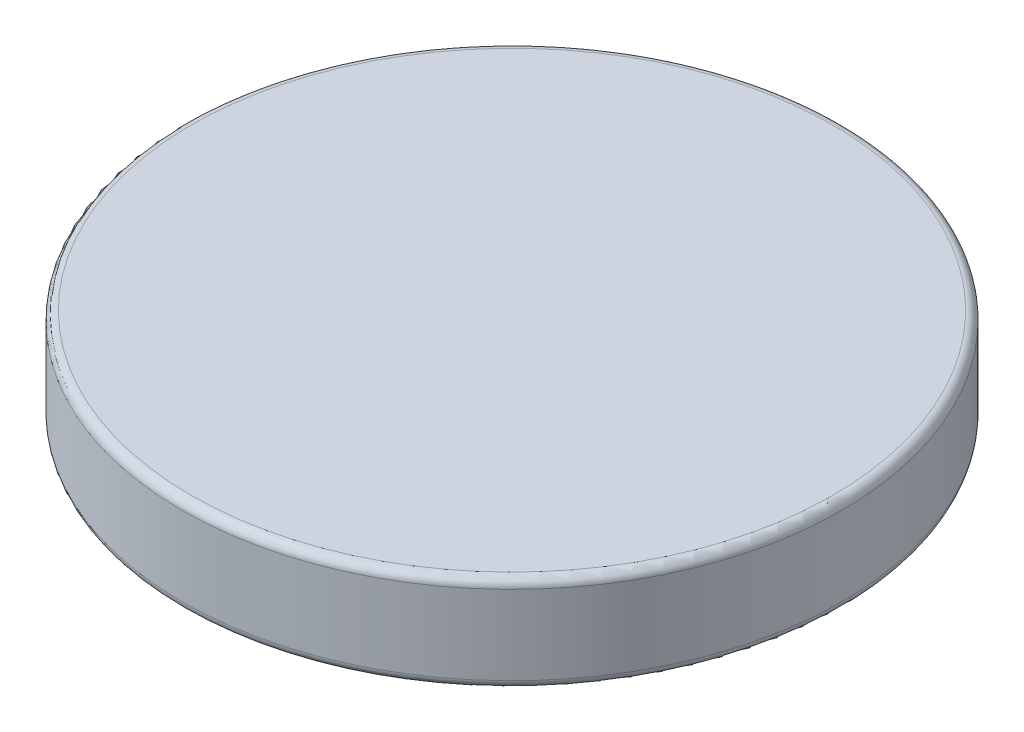
ISO-10303-21;
HEADER;
FILE_DESCRIPTION(('STEP AP214'),'2;1');
FILE_NAME('part.step','',(''),(''),'','','');
FILE_SCHEMA(('AUTOMOTIVE_DESIGN { 1 0 10303 214 1 1 1 1 }'));
ENDSEC;
DATA;
#1=APPLICATION_CONTEXT('core data for automotive mechanical design processes');
#2=APPLICATION_PROTOCOL_DEFINITION('international standard','automotive_design',2000,#1);
#3=PRODUCT_CONTEXT('',#1,'mechanical');
#4=PRODUCT('Part','Part','',(#3));
#5=PRODUCT_RELATED_PRODUCT_CATEGORY('part','',(#4));
#6=PRODUCT_DEFINITION_FORMATION('','',#4);
#7=PRODUCT_DEFINITION_CONTEXT('part definition',#1,'design');
#8=PRODUCT_DEFINITION('design','',#6,#7);
#9=PRODUCT_DEFINITION_SHAPE('','',#8);
#10=(LENGTH_UNIT() NAMED_UNIT(*) SI_UNIT(.MILLI.,.METRE.));
#11=(NAMED_UNIT(*) PLANE_ANGLE_UNIT() SI_UNIT($,.RADIAN.));
#12=(NAMED_UNIT(*) SI_UNIT($,.STERADIAN.) SOLID_ANGLE_UNIT());
#13=UNCERTAINTY_MEASURE_WITH_UNIT(LENGTH_MEASURE(1.E-05),#10,'distance_accuracy_value','');
#14=(GEOMETRIC_REPRESENTATION_CONTEXT(3) GLOBAL_UNCERTAINTY_ASSIGNED_CONTEXT((#13)) GLOBAL_UNIT_ASSIGNED_CONTEXT((#10,
#11,#12)) REPRESENTATION_CONTEXT('',''));
#15=CARTESIAN_POINT('',(0.,0.,0.));
#16=DIRECTION('',(0.,0.,1.));
#17=DIRECTION('',(1.,0.,0.));
#18=AXIS2_PLACEMENT_3D('',#15,#16,#17);
#19=CARTESIAN_POINT('',(0.,1.1,0.));
#20=DIRECTION('',(0.,-1.,0.));
#21=DIRECTION('',(0.,0.,-1.));
#22=AXIS2_PLACEMENT_3D('',#19,#20,#21);
#23=CYLINDRICAL_SURFACE('',#22,3.75);
#24=CARTESIAN_POINT('',(0.,0.1,0.));
#25=DIRECTION('',(0.,1.,0.));
#26=DIRECTION('',(0.,0.,1.));
#27=AXIS2_PLACEMENT_3D('',#24,#25,#26);
#28=CIRCLE('',#27,3.75);
#29=CARTESIAN_POINT('',(0.,0.1,3.75));
#30=VERTEX_POINT('',#29);
#31=EDGE_CURVE('E43',#30,#30,#28,.T.);
#32=ORIENTED_EDGE('',*,*,#31,.T.);
#33=EDGE_LOOP('',(#32));
#34=FACE_BOUND('',#33,.T.);
#35=CARTESIAN_POINT('',(0.,1.,0.));
#36=DIRECTION('',(0.,1.,0.));
#37=DIRECTION('',(0.,0.,1.));
#38=AXIS2_PLACEMENT_3D('',#35,#36,#37);
#39=CIRCLE('',#38,3.75);
#40=CARTESIAN_POINT('',(0.,1.,3.75));
#41=VERTEX_POINT('',#40);
#42=EDGE_CURVE('E47',#41,#41,#39,.F.);
#43=ORIENTED_EDGE('',*,*,#42,.T.);
#44=EDGE_LOOP('',(#43));
#45=FACE_BOUND('',#44,.T.);
#46=ADVANCED_FACE('F32',(#34,#45),#23,.T.);
#47=CARTESIAN_POINT('',(0.,1.1,0.));
#48=DIRECTION('',(0.,1.,0.));
#49=DIRECTION('',(0.,0.,1.));
#50=AXIS2_PLACEMENT_3D('',#47,#48,#49);
#51=PLANE('',#50);
#52=CARTESIAN_POINT('',(0.,1.1,0.));
#53=DIRECTION('',(0.,1.,0.));
#54=DIRECTION('',(0.,0.,1.));
#55=AXIS2_PLACEMENT_3D('',#52,#53,#54);
#56=CIRCLE('',#55,3.65);
#57=CARTESIAN_POINT('',(0.,1.1,3.65));
#58=VERTEX_POINT('',#57);
#59=EDGE_CURVE('E10',#58,#58,#56,.T.);
#60=ORIENTED_EDGE('',*,*,#59,.T.);
#61=EDGE_LOOP('',(#60));
#62=FACE_BOUND('',#61,.T.);
#63=ADVANCED_FACE('F63',(#62),#51,.T.);
#64=CARTESIAN_POINT('',(0.,0.,0.));
#65=DIRECTION('',(0.,1.,0.));
#66=DIRECTION('',(0.,0.,1.));
#67=AXIS2_PLACEMENT_3D('',#64,#65,#66);
#68=PLANE('',#67);
#69=CARTESIAN_POINT('',(0.,0.,0.));
#70=DIRECTION('',(0.,1.,0.));
#71=DIRECTION('',(0.,0.,1.));
#72=AXIS2_PLACEMENT_3D('',#69,#70,#71);
#73=CIRCLE('',#72,3.65);
#74=CARTESIAN_POINT('',(0.,0.,3.65));
#75=VERTEX_POINT('',#74);
#76=EDGE_CURVE('E39',#75,#75,#73,.F.);
#77=ORIENTED_EDGE('',*,*,#76,.T.);
#78=EDGE_LOOP('',(#77));
#79=FACE_BOUND('',#78,.T.);
#80=ADVANCED_FACE('F60',(#79),#68,.F.);
#81=CARTESIAN_POINT('',(0.,0.1,0.));
#82=DIRECTION('',(0.,1.,0.));
#83=DIRECTION('',(0.,0.,1.));
#84=AXIS2_PLACEMENT_3D('',#81,#82,#83);
#85=TOROIDAL_SURFACE('',#84,3.65,0.1);
#86=ORIENTED_EDGE('',*,*,#76,.F.);
#87=EDGE_LOOP('',(#86));
#88=FACE_BOUND('',#87,.T.);
#89=ORIENTED_EDGE('',*,*,#31,.F.);
#90=EDGE_LOOP('',(#89));
#91=FACE_BOUND('',#90,.T.);
#92=ADVANCED_FACE('F56',(#88,#91),#85,.T.);
#93=CARTESIAN_POINT('',(0.,1.,0.));
#94=DIRECTION('',(0.,1.,0.));
#95=DIRECTION('',(0.,0.,1.));
#96=AXIS2_PLACEMENT_3D('',#93,#94,#95);
#97=TOROIDAL_SURFACE('',#96,3.65,0.1);
#98=ORIENTED_EDGE('',*,*,#42,.F.);
#99=EDGE_LOOP('',(#98));
#100=FACE_BOUND('',#99,.T.);
#101=ORIENTED_EDGE('',*,*,#59,.F.);
#102=EDGE_LOOP('',(#101));
#103=FACE_BOUND('',#102,.T.);
#104=ADVANCED_FACE('F34',(#100,#103),#97,.T.);
#105=CLOSED_SHELL('',(#46,#63,#80,#92,#104));
#106=MANIFOLD_SOLID_BREP('B2',#105);
#107=ADVANCED_BREP_SHAPE_REPRESENTATION('',(#18,#106),#14);
#108=SHAPE_DEFINITION_REPRESENTATION(#9,#107);
ENDSEC;
END-ISO-10303-21;
